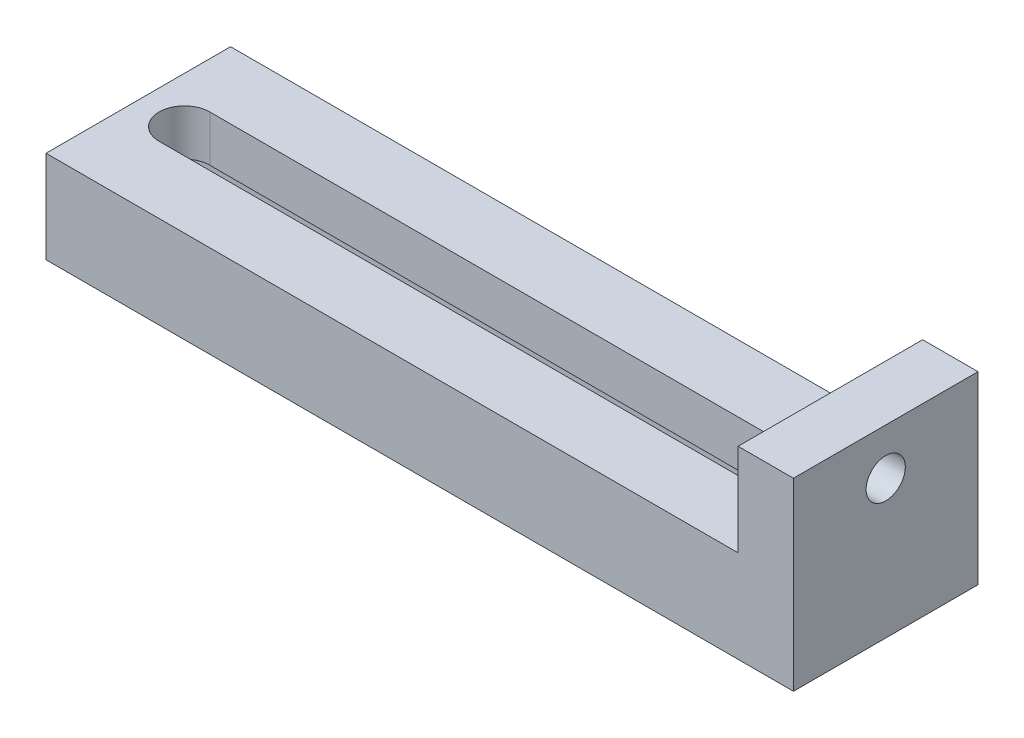
ISO-10303-21;
HEADER;
FILE_DESCRIPTION(('STEP AP214'),'2;1');
FILE_NAME('part.step','',(''),(''),'','','');
FILE_SCHEMA(('AUTOMOTIVE_DESIGN { 1 0 10303 214 1 1 1 1 }'));
ENDSEC;
DATA;
#1=APPLICATION_CONTEXT('core data for automotive mechanical design processes');
#2=APPLICATION_PROTOCOL_DEFINITION('international standard','automotive_design',2000,#1);
#3=PRODUCT_CONTEXT('',#1,'mechanical');
#4=PRODUCT('Part','Part','',(#3));
#5=PRODUCT_RELATED_PRODUCT_CATEGORY('part','',(#4));
#6=PRODUCT_DEFINITION_FORMATION('','',#4);
#7=PRODUCT_DEFINITION_CONTEXT('part definition',#1,'design');
#8=PRODUCT_DEFINITION('design','',#6,#7);
#9=PRODUCT_DEFINITION_SHAPE('','',#8);
#10=(LENGTH_UNIT() NAMED_UNIT(*) SI_UNIT(.MILLI.,.METRE.));
#11=(NAMED_UNIT(*) PLANE_ANGLE_UNIT() SI_UNIT($,.RADIAN.));
#12=(NAMED_UNIT(*) SI_UNIT($,.STERADIAN.) SOLID_ANGLE_UNIT());
#13=UNCERTAINTY_MEASURE_WITH_UNIT(LENGTH_MEASURE(1.E-05),#10,'distance_accuracy_value','');
#14=(GEOMETRIC_REPRESENTATION_CONTEXT(3) GLOBAL_UNCERTAINTY_ASSIGNED_CONTEXT((#13)) GLOBAL_UNIT_ASSIGNED_CONTEXT((#10,
#11,#12)) REPRESENTATION_CONTEXT('',''));
#15=CARTESIAN_POINT('',(0.,0.,0.));
#16=DIRECTION('',(0.,0.,1.));
#17=DIRECTION('',(1.,0.,0.));
#18=AXIS2_PLACEMENT_3D('',#15,#16,#17);
#19=CARTESIAN_POINT('',(-75.,20.,-20.));
#20=DIRECTION('',(0.,0.,1.));
#21=DIRECTION('',(1.,0.,0.));
#22=AXIS2_PLACEMENT_3D('',#19,#20,#21);
#23=PLANE('',#22);
#24=DIRECTION('',(-1.,0.,0.));
#25=VECTOR('',#24,1.);
#26=CARTESIAN_POINT('',(-75.,0.,-20.));
#27=LINE('',#26,#25);
#28=CARTESIAN_POINT('',(87.,0.,-20.));
#29=VERTEX_POINT('',#28);
#30=CARTESIAN_POINT('',(-75.,0.,-20.));
#31=VERTEX_POINT('',#30);
#32=EDGE_CURVE('E176',#29,#31,#27,.T.);
#33=ORIENTED_EDGE('',*,*,#32,.T.);
#34=DIRECTION('',(0.,-1.,0.));
#35=VECTOR('',#34,1.);
#36=CARTESIAN_POINT('',(-75.,20.,-20.));
#37=LINE('',#36,#35);
#38=CARTESIAN_POINT('',(-75.,20.,-20.));
#39=VERTEX_POINT('',#38);
#40=EDGE_CURVE('E51',#39,#31,#37,.T.);
#41=ORIENTED_EDGE('',*,*,#40,.F.);
#42=DIRECTION('',(-1.,0.,0.));
#43=VECTOR('',#42,1.);
#44=CARTESIAN_POINT('',(-75.,20.,-20.));
#45=LINE('',#44,#43);
#46=CARTESIAN_POINT('',(75.,20.,-20.));
#47=VERTEX_POINT('',#46);
#48=EDGE_CURVE('E190',#47,#39,#45,.T.);
#49=ORIENTED_EDGE('',*,*,#48,.F.);
#50=DIRECTION('',(0.,-1.,0.));
#51=VECTOR('',#50,1.);
#52=CARTESIAN_POINT('',(75.,40.,-20.));
#53=LINE('',#52,#51);
#54=CARTESIAN_POINT('',(75.,40.,-20.));
#55=VERTEX_POINT('',#54);
#56=EDGE_CURVE('E198',#55,#47,#53,.T.);
#57=ORIENTED_EDGE('',*,*,#56,.F.);
#58=DIRECTION('',(1.,0.,0.));
#59=VECTOR('',#58,1.);
#60=CARTESIAN_POINT('',(75.,40.,-20.));
#61=LINE('',#60,#59);
#62=CARTESIAN_POINT('',(87.,40.,-20.));
#63=VERTEX_POINT('',#62);
#64=EDGE_CURVE('E227',#55,#63,#61,.T.);
#65=ORIENTED_EDGE('',*,*,#64,.T.);
#66=DIRECTION('',(0.,-1.,0.));
#67=VECTOR('',#66,1.);
#68=CARTESIAN_POINT('',(87.,40.,-20.));
#69=LINE('',#68,#67);
#70=EDGE_CURVE('E201',#63,#29,#69,.T.);
#71=ORIENTED_EDGE('',*,*,#70,.T.);
#72=EDGE_LOOP('',(#33,#41,#49,#57,#65,#71));
#73=FACE_BOUND('',#72,.T.);
#74=ADVANCED_FACE('F43',(#73),#23,.F.);
#75=CARTESIAN_POINT('',(-75.,20.,-20.));
#76=DIRECTION('',(1.,0.,0.));
#77=DIRECTION('',(0.,0.,-1.));
#78=AXIS2_PLACEMENT_3D('',#75,#76,#77);
#79=PLANE('',#78);
#80=DIRECTION('',(0.,0.,1.));
#81=VECTOR('',#80,1.);
#82=CARTESIAN_POINT('',(-75.,0.,-20.));
#83=LINE('',#82,#81);
#84=CARTESIAN_POINT('',(-75.,0.,-8.));
#85=VERTEX_POINT('',#84);
#86=EDGE_CURVE('E156',#31,#85,#83,.T.);
#87=ORIENTED_EDGE('',*,*,#86,.T.);
#88=DIRECTION('',(0.,-1.,0.));
#89=VECTOR('',#88,1.);
#90=CARTESIAN_POINT('',(-75.,0.,-8.));
#91=LINE('',#90,#89);
#92=CARTESIAN_POINT('',(-75.,10.,-8.));
#93=VERTEX_POINT('',#92);
#94=EDGE_CURVE('E141',#93,#85,#91,.T.);
#95=ORIENTED_EDGE('',*,*,#94,.F.);
#96=DIRECTION('',(0.,0.,-1.));
#97=VECTOR('',#96,1.);
#98=CARTESIAN_POINT('',(-75.,10.,-8.));
#99=LINE('',#98,#97);
#100=CARTESIAN_POINT('',(-75.,10.,8.));
#101=VERTEX_POINT('',#100);
#102=EDGE_CURVE('E162',#101,#93,#99,.T.);
#103=ORIENTED_EDGE('',*,*,#102,.F.);
#104=DIRECTION('',(0.,1.,0.));
#105=VECTOR('',#104,1.);
#106=CARTESIAN_POINT('',(-75.,0.,8.));
#107=LINE('',#106,#105);
#108=CARTESIAN_POINT('',(-75.,0.,8.));
#109=VERTEX_POINT('',#108);
#110=EDGE_CURVE('E150',#109,#101,#107,.T.);
#111=ORIENTED_EDGE('',*,*,#110,.F.);
#112=CARTESIAN_POINT('',(-75.,0.,20.));
#113=VERTEX_POINT('',#112);
#114=EDGE_CURVE('E170',#109,#113,#83,.T.);
#115=ORIENTED_EDGE('',*,*,#114,.T.);
#116=DIRECTION('',(0.,-1.,0.));
#117=VECTOR('',#116,1.);
#118=CARTESIAN_POINT('',(-75.,20.,20.));
#119=LINE('',#118,#117);
#120=CARTESIAN_POINT('',(-75.,20.,20.));
#121=VERTEX_POINT('',#120);
#122=EDGE_CURVE('E180',#121,#113,#119,.T.);
#123=ORIENTED_EDGE('',*,*,#122,.F.);
#124=DIRECTION('',(0.,0.,1.));
#125=VECTOR('',#124,1.);
#126=CARTESIAN_POINT('',(-75.,20.,-20.));
#127=LINE('',#126,#125);
#128=EDGE_CURVE('E188',#39,#121,#127,.T.);
#129=ORIENTED_EDGE('',*,*,#128,.F.);
#130=ORIENTED_EDGE('',*,*,#40,.T.);
#131=EDGE_LOOP('',(#87,#95,#103,#111,#115,#123,#129,#130));
#132=FACE_BOUND('',#131,.T.);
#133=ADVANCED_FACE('F165',(#132),#79,.F.);
#134=CARTESIAN_POINT('',(-75.,20.,20.));
#135=DIRECTION('',(0.,0.,-1.));
#136=DIRECTION('',(-1.,0.,0.));
#137=AXIS2_PLACEMENT_3D('',#134,#135,#136);
#138=PLANE('',#137);
#139=DIRECTION('',(1.,0.,0.));
#140=VECTOR('',#139,1.);
#141=CARTESIAN_POINT('',(-75.,0.,20.));
#142=LINE('',#141,#140);
#143=CARTESIAN_POINT('',(87.,0.,20.));
#144=VERTEX_POINT('',#143);
#145=EDGE_CURVE('E169',#113,#144,#142,.T.);
#146=ORIENTED_EDGE('',*,*,#145,.T.);
#147=DIRECTION('',(0.,-1.,0.));
#148=VECTOR('',#147,1.);
#149=CARTESIAN_POINT('',(87.,40.,20.));
#150=LINE('',#149,#148);
#151=CARTESIAN_POINT('',(87.,40.,20.));
#152=VERTEX_POINT('',#151);
#153=EDGE_CURVE('E206',#152,#144,#150,.T.);
#154=ORIENTED_EDGE('',*,*,#153,.F.);
#155=DIRECTION('',(-1.,0.,0.));
#156=VECTOR('',#155,1.);
#157=CARTESIAN_POINT('',(75.,40.,20.));
#158=LINE('',#157,#156);
#159=CARTESIAN_POINT('',(75.,40.,20.));
#160=VERTEX_POINT('',#159);
#161=EDGE_CURVE('E202',#152,#160,#158,.T.);
#162=ORIENTED_EDGE('',*,*,#161,.T.);
#163=DIRECTION('',(0.,-1.,0.));
#164=VECTOR('',#163,1.);
#165=CARTESIAN_POINT('',(75.,40.,20.));
#166=LINE('',#165,#164);
#167=CARTESIAN_POINT('',(75.,20.,20.));
#168=VERTEX_POINT('',#167);
#169=EDGE_CURVE('E210',#160,#168,#166,.T.);
#170=ORIENTED_EDGE('',*,*,#169,.T.);
#171=DIRECTION('',(1.,0.,0.));
#172=VECTOR('',#171,1.);
#173=CARTESIAN_POINT('',(-75.,20.,20.));
#174=LINE('',#173,#172);
#175=EDGE_CURVE('E183',#121,#168,#174,.T.);
#176=ORIENTED_EDGE('',*,*,#175,.F.);
#177=ORIENTED_EDGE('',*,*,#122,.T.);
#178=EDGE_LOOP('',(#146,#154,#162,#170,#176,#177));
#179=FACE_BOUND('',#178,.T.);
#180=ADVANCED_FACE('F313',(#179),#138,.F.);
#181=CARTESIAN_POINT('',(0.,20.,0.));
#182=DIRECTION('',(0.,1.,0.));
#183=DIRECTION('',(0.,0.,1.));
#184=AXIS2_PLACEMENT_3D('',#181,#182,#183);
#185=PLANE('',#184);
#186=DIRECTION('',(1.,0.,0.));
#187=VECTOR('',#186,1.);
#188=CARTESIAN_POINT('',(0.,20.,5.50000000000045));
#189=LINE('',#188,#187);
#190=CARTESIAN_POINT('',(-65.,20.,5.50000000000046));
#191=VERTEX_POINT('',#190);
#192=CARTESIAN_POINT('',(65.,20.,5.50000000000044));
#193=VERTEX_POINT('',#192);
#194=EDGE_CURVE('E257',#191,#193,#189,.T.);
#195=ORIENTED_EDGE('',*,*,#194,.F.);
#196=CARTESIAN_POINT('',(-65.,20.,4.57966997657877E-13));
#197=DIRECTION('',(0.,1.,0.));
#198=DIRECTION('',(0.,0.,1.));
#199=AXIS2_PLACEMENT_3D('',#196,#197,#198);
#200=CIRCLE('',#199,5.49999999999999);
#201=CARTESIAN_POINT('',(-65.,20.,-5.49999999999951));
#202=VERTEX_POINT('',#201);
#203=EDGE_CURVE('E238',#202,#191,#200,.T.);
#204=ORIENTED_EDGE('',*,*,#203,.F.);
#205=DIRECTION('',(1.,0.,0.));
#206=VECTOR('',#205,1.);
#207=CARTESIAN_POINT('',(0.,20.,-5.49999999999953));
#208=LINE('',#207,#206);
#209=CARTESIAN_POINT('',(65.,20.,-5.49999999999956));
#210=VERTEX_POINT('',#209);
#211=EDGE_CURVE('E249',#202,#210,#208,.T.);
#212=ORIENTED_EDGE('',*,*,#211,.T.);
#213=CARTESIAN_POINT('',(65.,20.,4.44089209850063E-13));
#214=DIRECTION('',(0.,1.,0.));
#215=DIRECTION('',(0.,0.,1.));
#216=AXIS2_PLACEMENT_3D('',#213,#214,#215);
#217=CIRCLE('',#216,5.5);
#218=EDGE_CURVE('E253',#193,#210,#217,.T.);
#219=ORIENTED_EDGE('',*,*,#218,.F.);
#220=EDGE_LOOP('',(#195,#204,#212,#219));
#221=FACE_BOUND('',#220,.T.);
#222=DIRECTION('',(0.,0.,-1.));
#223=VECTOR('',#222,1.);
#224=CARTESIAN_POINT('',(75.,20.,-20.));
#225=LINE('',#224,#223);
#226=EDGE_CURVE('E174',#168,#47,#225,.T.);
#227=ORIENTED_EDGE('',*,*,#226,.T.);
#228=ORIENTED_EDGE('',*,*,#48,.T.);
#229=ORIENTED_EDGE('',*,*,#128,.T.);
#230=ORIENTED_EDGE('',*,*,#175,.T.);
#231=EDGE_LOOP('',(#227,#228,#229,#230));
#232=FACE_BOUND('',#231,.T.);
#233=ADVANCED_FACE('F314',(#221,#232),#185,.T.);
#234=CARTESIAN_POINT('',(0.,0.,0.));
#235=DIRECTION('',(0.,1.,0.));
#236=DIRECTION('',(0.,0.,1.));
#237=AXIS2_PLACEMENT_3D('',#234,#235,#236);
#238=PLANE('',#237);
#239=DIRECTION('',(0.,0.,-1.));
#240=VECTOR('',#239,1.);
#241=CARTESIAN_POINT('',(75.,0.,-8.));
#242=LINE('',#241,#240);
#243=CARTESIAN_POINT('',(75.,0.,8.));
#244=VERTEX_POINT('',#243);
#245=CARTESIAN_POINT('',(75.,0.,-8.));
#246=VERTEX_POINT('',#245);
#247=EDGE_CURVE('E159',#244,#246,#242,.T.);
#248=ORIENTED_EDGE('',*,*,#247,.T.);
#249=DIRECTION('',(-1.,0.,0.));
#250=VECTOR('',#249,1.);
#251=CARTESIAN_POINT('',(93.8679622641132,0.,-8.));
#252=LINE('',#251,#250);
#253=EDGE_CURVE('E58',#246,#85,#252,.T.);
#254=ORIENTED_EDGE('',*,*,#253,.T.);
#255=ORIENTED_EDGE('',*,*,#86,.F.);
#256=ORIENTED_EDGE('',*,*,#32,.F.);
#257=DIRECTION('',(0.,0.,1.));
#258=VECTOR('',#257,1.);
#259=CARTESIAN_POINT('',(87.,0.,20.));
#260=LINE('',#259,#258);
#261=EDGE_CURVE('E214',#29,#144,#260,.T.);
#262=ORIENTED_EDGE('',*,*,#261,.T.);
#263=ORIENTED_EDGE('',*,*,#145,.F.);
#264=ORIENTED_EDGE('',*,*,#114,.F.);
#265=DIRECTION('',(-1.,0.,0.));
#266=VECTOR('',#265,1.);
#267=CARTESIAN_POINT('',(93.8679622641132,0.,8.));
#268=LINE('',#267,#266);
#269=EDGE_CURVE('E161',#244,#109,#268,.T.);
#270=ORIENTED_EDGE('',*,*,#269,.F.);
#271=EDGE_LOOP('',(#248,#254,#255,#256,#262,#263,#264,#270));
#272=FACE_BOUND('',#271,.T.);
#273=ADVANCED_FACE('F155',(#272),#238,.F.);
#274=CARTESIAN_POINT('',(75.,40.,20.));
#275=DIRECTION('',(-1.,0.,0.));
#276=DIRECTION('',(0.,0.,1.));
#277=AXIS2_PLACEMENT_3D('',#274,#275,#276);
#278=PLANE('',#277);
#279=CARTESIAN_POINT('',(75.,30.,0.));
#280=DIRECTION('',(-1.,0.,0.));
#281=DIRECTION('',(0.,0.,1.));
#282=AXIS2_PLACEMENT_3D('',#279,#280,#281);
#283=CIRCLE('',#282,4.24999999999999);
#284=CARTESIAN_POINT('',(75.,30.,4.24999999999999));
#285=VERTEX_POINT('',#284);
#286=EDGE_CURVE('E261',#285,#285,#283,.T.);
#287=ORIENTED_EDGE('',*,*,#286,.F.);
#288=EDGE_LOOP('',(#287));
#289=FACE_BOUND('',#288,.T.);
#290=ORIENTED_EDGE('',*,*,#226,.F.);
#291=ORIENTED_EDGE('',*,*,#169,.F.);
#292=DIRECTION('',(0.,0.,-1.));
#293=VECTOR('',#292,1.);
#294=CARTESIAN_POINT('',(75.,40.,20.));
#295=LINE('',#294,#293);
#296=EDGE_CURVE('E218',#160,#55,#295,.T.);
#297=ORIENTED_EDGE('',*,*,#296,.T.);
#298=ORIENTED_EDGE('',*,*,#56,.T.);
#299=EDGE_LOOP('',(#290,#291,#297,#298));
#300=FACE_BOUND('',#299,.T.);
#301=ADVANCED_FACE('F328',(#289,#300),#278,.T.);
#302=CARTESIAN_POINT('',(87.,40.,20.));
#303=DIRECTION('',(1.,0.,0.));
#304=DIRECTION('',(0.,0.,-1.));
#305=AXIS2_PLACEMENT_3D('',#302,#303,#304);
#306=PLANE('',#305);
#307=CARTESIAN_POINT('',(87.,30.,0.));
#308=DIRECTION('',(1.,0.,0.));
#309=DIRECTION('',(0.,0.,-1.));
#310=AXIS2_PLACEMENT_3D('',#307,#308,#309);
#311=CIRCLE('',#310,4.24999999999999);
#312=CARTESIAN_POINT('',(87.,30.,-4.24999999999999));
#313=VERTEX_POINT('',#312);
#314=EDGE_CURVE('E265',#313,#313,#311,.T.);
#315=ORIENTED_EDGE('',*,*,#314,.F.);
#316=EDGE_LOOP('',(#315));
#317=FACE_BOUND('',#316,.T.);
#318=ORIENTED_EDGE('',*,*,#261,.F.);
#319=ORIENTED_EDGE('',*,*,#70,.F.);
#320=DIRECTION('',(0.,0.,1.));
#321=VECTOR('',#320,1.);
#322=CARTESIAN_POINT('',(87.,40.,20.));
#323=LINE('',#322,#321);
#324=EDGE_CURVE('E223',#63,#152,#323,.T.);
#325=ORIENTED_EDGE('',*,*,#324,.T.);
#326=ORIENTED_EDGE('',*,*,#153,.T.);
#327=EDGE_LOOP('',(#318,#319,#325,#326));
#328=FACE_BOUND('',#327,.T.);
#329=ADVANCED_FACE('F320',(#317,#328),#306,.T.);
#330=CARTESIAN_POINT('',(0.,40.,0.));
#331=DIRECTION('',(0.,-1.,0.));
#332=DIRECTION('',(0.,0.,-1.));
#333=AXIS2_PLACEMENT_3D('',#330,#331,#332);
#334=PLANE('',#333);
#335=ORIENTED_EDGE('',*,*,#296,.F.);
#336=ORIENTED_EDGE('',*,*,#161,.F.);
#337=ORIENTED_EDGE('',*,*,#324,.F.);
#338=ORIENTED_EDGE('',*,*,#64,.F.);
#339=EDGE_LOOP('',(#335,#336,#337,#338));
#340=FACE_BOUND('',#339,.T.);
#341=ADVANCED_FACE('F325',(#340),#334,.F.);
#342=CARTESIAN_POINT('',(0.,-20.,5.50000000000045));
#343=DIRECTION('',(0.,0.,1.));
#344=DIRECTION('',(1.,0.,0.));
#345=AXIS2_PLACEMENT_3D('',#342,#343,#344);
#346=PLANE('',#345);
#347=DIRECTION('',(0.,1.,0.));
#348=VECTOR('',#347,1.);
#349=CARTESIAN_POINT('',(65.,-20.,5.50000000000044));
#350=LINE('',#349,#348);
#351=CARTESIAN_POINT('',(65.,10.,5.50000000000044));
#352=VERTEX_POINT('',#351);
#353=EDGE_CURVE('E234',#352,#193,#350,.T.);
#354=ORIENTED_EDGE('',*,*,#353,.F.);
#355=DIRECTION('',(-1.,0.,0.));
#356=VECTOR('',#355,1.);
#357=CARTESIAN_POINT('',(0.,10.,5.50000000000045));
#358=LINE('',#357,#356);
#359=CARTESIAN_POINT('',(-65.,10.,5.50000000000044));
#360=VERTEX_POINT('',#359);
#361=EDGE_CURVE('E66',#352,#360,#358,.T.);
#362=ORIENTED_EDGE('',*,*,#361,.T.);
#363=DIRECTION('',(0.,1.,0.));
#364=VECTOR('',#363,1.);
#365=CARTESIAN_POINT('',(-65.,-20.,5.50000000000046));
#366=LINE('',#365,#364);
#367=EDGE_CURVE('E219',#360,#191,#366,.T.);
#368=ORIENTED_EDGE('',*,*,#367,.T.);
#369=ORIENTED_EDGE('',*,*,#194,.T.);
#370=EDGE_LOOP('',(#354,#362,#368,#369));
#371=FACE_BOUND('',#370,.T.);
#372=ADVANCED_FACE('F358',(#371),#346,.F.);
#373=CARTESIAN_POINT('',(-65.,-20.,4.57966997657877E-13));
#374=DIRECTION('',(0.,1.,0.));
#375=DIRECTION('',(0.,0.,1.));
#376=AXIS2_PLACEMENT_3D('',#373,#374,#375);
#377=CYLINDRICAL_SURFACE('',#376,5.49999999999999);
#378=ORIENTED_EDGE('',*,*,#367,.F.);
#379=CARTESIAN_POINT('',(-65.,10.,4.57966997657877E-13));
#380=DIRECTION('',(0.,1.,0.));
#381=DIRECTION('',(0.,0.,1.));
#382=AXIS2_PLACEMENT_3D('',#379,#380,#381);
#383=CIRCLE('',#382,5.49999999999999);
#384=CARTESIAN_POINT('',(-65.,10.,-5.49999999999951));
#385=VERTEX_POINT('',#384);
#386=EDGE_CURVE('E271',#360,#385,#383,.F.);
#387=ORIENTED_EDGE('',*,*,#386,.T.);
#388=DIRECTION('',(0.,1.,0.));
#389=VECTOR('',#388,1.);
#390=CARTESIAN_POINT('',(-65.,-20.,-5.49999999999951));
#391=LINE('',#390,#389);
#392=EDGE_CURVE('E241',#385,#202,#391,.T.);
#393=ORIENTED_EDGE('',*,*,#392,.T.);
#394=ORIENTED_EDGE('',*,*,#203,.T.);
#395=EDGE_LOOP('',(#378,#387,#393,#394));
#396=FACE_BOUND('',#395,.T.);
#397=ADVANCED_FACE('F361',(#396),#377,.F.);
#398=CARTESIAN_POINT('',(0.,-20.,-5.49999999999953));
#399=DIRECTION('',(0.,0.,1.));
#400=DIRECTION('',(1.,0.,0.));
#401=AXIS2_PLACEMENT_3D('',#398,#399,#400);
#402=PLANE('',#401);
#403=DIRECTION('',(-1.,0.,0.));
#404=VECTOR('',#403,1.);
#405=CARTESIAN_POINT('',(0.,10.,-5.49999999999953));
#406=LINE('',#405,#404);
#407=CARTESIAN_POINT('',(65.,10.,-5.49999999999956));
#408=VERTEX_POINT('',#407);
#409=EDGE_CURVE('E275',#408,#385,#406,.T.);
#410=ORIENTED_EDGE('',*,*,#409,.F.);
#411=DIRECTION('',(0.,1.,0.));
#412=VECTOR('',#411,1.);
#413=CARTESIAN_POINT('',(65.,-20.,-5.49999999999956));
#414=LINE('',#413,#412);
#415=EDGE_CURVE('E237',#408,#210,#414,.T.);
#416=ORIENTED_EDGE('',*,*,#415,.T.);
#417=ORIENTED_EDGE('',*,*,#211,.F.);
#418=ORIENTED_EDGE('',*,*,#392,.F.);
#419=EDGE_LOOP('',(#410,#416,#417,#418));
#420=FACE_BOUND('',#419,.T.);
#421=ADVANCED_FACE('F366',(#420),#402,.T.);
#422=CARTESIAN_POINT('',(65.,-20.,4.44089209850063E-13));
#423=DIRECTION('',(0.,1.,0.));
#424=DIRECTION('',(0.,0.,1.));
#425=AXIS2_PLACEMENT_3D('',#422,#423,#424);
#426=CYLINDRICAL_SURFACE('',#425,5.5);
#427=ORIENTED_EDGE('',*,*,#415,.F.);
#428=CARTESIAN_POINT('',(65.,10.,4.44089209850063E-13));
#429=DIRECTION('',(0.,1.,0.));
#430=DIRECTION('',(0.,0.,1.));
#431=AXIS2_PLACEMENT_3D('',#428,#429,#430);
#432=CIRCLE('',#431,5.5);
#433=EDGE_CURVE('E11',#408,#352,#432,.F.);
#434=ORIENTED_EDGE('',*,*,#433,.T.);
#435=ORIENTED_EDGE('',*,*,#353,.T.);
#436=ORIENTED_EDGE('',*,*,#218,.T.);
#437=EDGE_LOOP('',(#427,#434,#435,#436));
#438=FACE_BOUND('',#437,.T.);
#439=ADVANCED_FACE('F369',(#438),#426,.F.);
#440=CARTESIAN_POINT('',(87.,30.,0.));
#441=DIRECTION('',(1.,0.,0.));
#442=DIRECTION('',(0.,0.,-1.));
#443=AXIS2_PLACEMENT_3D('',#440,#441,#442);
#444=CYLINDRICAL_SURFACE('',#443,4.24999999999999);
#445=ORIENTED_EDGE('',*,*,#286,.T.);
#446=EDGE_LOOP('',(#445));
#447=FACE_BOUND('',#446,.T.);
#448=ORIENTED_EDGE('',*,*,#314,.T.);
#449=EDGE_LOOP('',(#448));
#450=FACE_BOUND('',#449,.T.);
#451=ADVANCED_FACE('F372',(#447,#450),#444,.F.);
#452=CARTESIAN_POINT('',(93.8679622641132,10.,-8.));
#453=DIRECTION('',(0.,1.,0.));
#454=DIRECTION('',(0.,0.,1.));
#455=AXIS2_PLACEMENT_3D('',#452,#453,#454);
#456=PLANE('',#455);
#457=DIRECTION('',(0.,0.,1.));
#458=VECTOR('',#457,1.);
#459=CARTESIAN_POINT('',(75.,10.,-8.));
#460=LINE('',#459,#458);
#461=CARTESIAN_POINT('',(75.,10.,-8.));
#462=VERTEX_POINT('',#461);
#463=CARTESIAN_POINT('',(75.,10.,8.));
#464=VERTEX_POINT('',#463);
#465=EDGE_CURVE('E296',#462,#464,#460,.T.);
#466=ORIENTED_EDGE('',*,*,#465,.T.);
#467=DIRECTION('',(-1.,0.,0.));
#468=VECTOR('',#467,1.);
#469=CARTESIAN_POINT('',(93.8679622641132,10.,8.));
#470=LINE('',#469,#468);
#471=EDGE_CURVE('E283',#464,#101,#470,.T.);
#472=ORIENTED_EDGE('',*,*,#471,.T.);
#473=ORIENTED_EDGE('',*,*,#102,.T.);
#474=DIRECTION('',(-1.,0.,0.));
#475=VECTOR('',#474,1.);
#476=CARTESIAN_POINT('',(93.8679622641132,10.,-8.));
#477=LINE('',#476,#475);
#478=EDGE_CURVE('E144',#462,#93,#477,.T.);
#479=ORIENTED_EDGE('',*,*,#478,.F.);
#480=EDGE_LOOP('',(#466,#472,#473,#479));
#481=FACE_BOUND('',#480,.T.);
#482=ORIENTED_EDGE('',*,*,#433,.F.);
#483=ORIENTED_EDGE('',*,*,#409,.T.);
#484=ORIENTED_EDGE('',*,*,#386,.F.);
#485=ORIENTED_EDGE('',*,*,#361,.F.);
#486=EDGE_LOOP('',(#482,#483,#484,#485));
#487=FACE_BOUND('',#486,.T.);
#488=ADVANCED_FACE('F370',(#481,#487),#456,.F.);
#489=CARTESIAN_POINT('',(93.8679622641132,0.,-8.));
#490=DIRECTION('',(0.,0.,-1.));
#491=DIRECTION('',(0.,1.,0.));
#492=AXIS2_PLACEMENT_3D('',#489,#490,#491);
#493=PLANE('',#492);
#494=DIRECTION('',(0.,1.,0.));
#495=VECTOR('',#494,1.);
#496=CARTESIAN_POINT('',(75.,0.,-8.));
#497=LINE('',#496,#495);
#498=EDGE_CURVE('E279',#246,#462,#497,.T.);
#499=ORIENTED_EDGE('',*,*,#498,.T.);
#500=ORIENTED_EDGE('',*,*,#478,.T.);
#501=ORIENTED_EDGE('',*,*,#94,.T.);
#502=ORIENTED_EDGE('',*,*,#253,.F.);
#503=EDGE_LOOP('',(#499,#500,#501,#502));
#504=FACE_BOUND('',#503,.T.);
#505=ADVANCED_FACE('F142',(#504),#493,.F.);
#506=CARTESIAN_POINT('',(93.8679622641132,0.,8.));
#507=DIRECTION('',(0.,0.,1.));
#508=DIRECTION('',(0.,-1.,0.));
#509=AXIS2_PLACEMENT_3D('',#506,#507,#508);
#510=PLANE('',#509);
#511=DIRECTION('',(0.,-1.,0.));
#512=VECTOR('',#511,1.);
#513=CARTESIAN_POINT('',(75.,0.,8.));
#514=LINE('',#513,#512);
#515=EDGE_CURVE('E288',#464,#244,#514,.T.);
#516=ORIENTED_EDGE('',*,*,#515,.T.);
#517=ORIENTED_EDGE('',*,*,#269,.T.);
#518=ORIENTED_EDGE('',*,*,#110,.T.);
#519=ORIENTED_EDGE('',*,*,#471,.F.);
#520=EDGE_LOOP('',(#516,#517,#518,#519));
#521=FACE_BOUND('',#520,.T.);
#522=ADVANCED_FACE('F303',(#521),#510,.F.);
#523=CARTESIAN_POINT('',(75.,40.,20.));
#524=DIRECTION('',(-1.,0.,0.));
#525=DIRECTION('',(0.,0.,1.));
#526=AXIS2_PLACEMENT_3D('',#523,#524,#525);
#527=PLANE('',#526);
#528=ORIENTED_EDGE('',*,*,#498,.F.);
#529=ORIENTED_EDGE('',*,*,#247,.F.);
#530=ORIENTED_EDGE('',*,*,#515,.F.);
#531=ORIENTED_EDGE('',*,*,#465,.F.);
#532=EDGE_LOOP('',(#528,#529,#530,#531));
#533=FACE_BOUND('',#532,.T.);
#534=ADVANCED_FACE('F307',(#533),#527,.T.);
#535=CLOSED_SHELL('',(#74,#133,#180,#233,#273,#301,#329,#341,#372,#397,#421,#439,#451,#488,#505,
#522,#534));
#536=MANIFOLD_SOLID_BREP('B2',#535);
#537=ADVANCED_BREP_SHAPE_REPRESENTATION('',(#18,#536),#14);
#538=SHAPE_DEFINITION_REPRESENTATION(#9,#537);
ENDSEC;
END-ISO-10303-21;
